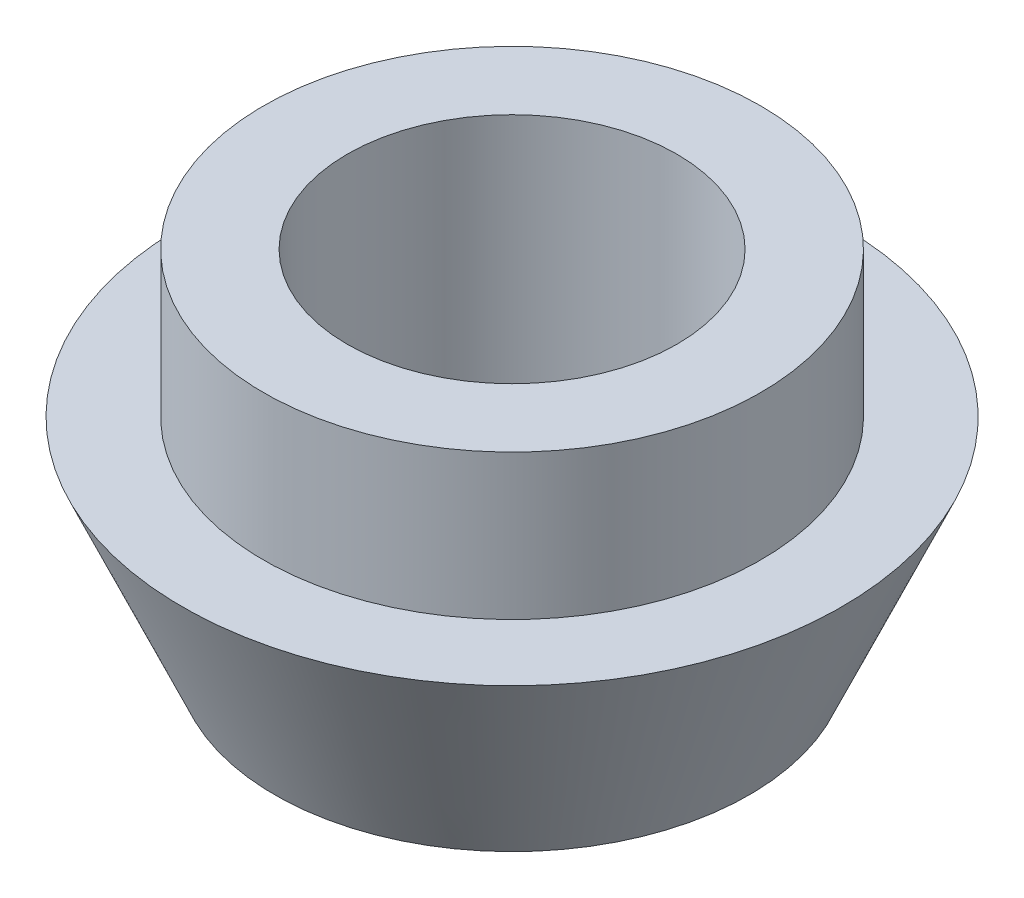
ISO-10303-21;
HEADER;
FILE_DESCRIPTION(('STEP AP214'),'2;1');
FILE_NAME('part.step','',(''),(''),'','','');
FILE_SCHEMA(('AUTOMOTIVE_DESIGN { 1 0 10303 214 1 1 1 1 }'));
ENDSEC;
DATA;
#1=APPLICATION_CONTEXT('core data for automotive mechanical design processes');
#2=APPLICATION_PROTOCOL_DEFINITION('international standard','automotive_design',2000,#1);
#3=PRODUCT_CONTEXT('',#1,'mechanical');
#4=PRODUCT('Part','Part','',(#3));
#5=PRODUCT_RELATED_PRODUCT_CATEGORY('part','',(#4));
#6=PRODUCT_DEFINITION_FORMATION('','',#4);
#7=PRODUCT_DEFINITION_CONTEXT('part definition',#1,'design');
#8=PRODUCT_DEFINITION('design','',#6,#7);
#9=PRODUCT_DEFINITION_SHAPE('','',#8);
#10=(LENGTH_UNIT() NAMED_UNIT(*) SI_UNIT(.MILLI.,.METRE.));
#11=(NAMED_UNIT(*) PLANE_ANGLE_UNIT() SI_UNIT($,.RADIAN.));
#12=(NAMED_UNIT(*) SI_UNIT($,.STERADIAN.) SOLID_ANGLE_UNIT());
#13=UNCERTAINTY_MEASURE_WITH_UNIT(LENGTH_MEASURE(1.E-05),#10,'distance_accuracy_value','');
#14=(GEOMETRIC_REPRESENTATION_CONTEXT(3) GLOBAL_UNCERTAINTY_ASSIGNED_CONTEXT((#13)) GLOBAL_UNIT_ASSIGNED_CONTEXT((#10,
#11,#12)) REPRESENTATION_CONTEXT('',''));
#15=CARTESIAN_POINT('',(0.,0.,0.));
#16=DIRECTION('',(0.,0.,1.));
#17=DIRECTION('',(1.,0.,0.));
#18=AXIS2_PLACEMENT_3D('',#15,#16,#17);
#19=CARTESIAN_POINT('',(4.572,0.,0.));
#20=DIRECTION('',(0.,-1.,0.));
#21=DIRECTION('',(0.,0.,-1.));
#22=AXIS2_PLACEMENT_3D('',#19,#20,#21);
#23=PLANE('',#22);
#24=CARTESIAN_POINT('',(0.,0.,0.));
#25=DIRECTION('',(0.,-1.,0.));
#26=DIRECTION('',(0.,0.,-1.));
#27=AXIS2_PLACEMENT_3D('',#24,#25,#26);
#28=CIRCLE('',#27,4.572);
#29=CARTESIAN_POINT('',(0.,0.,-4.572));
#30=VERTEX_POINT('',#29);
#31=EDGE_CURVE('E55',#30,#30,#28,.T.);
#32=ORIENTED_EDGE('',*,*,#31,.T.);
#33=EDGE_LOOP('',(#32));
#34=FACE_BOUND('',#33,.T.);
#35=CARTESIAN_POINT('',(0.,0.,0.));
#36=DIRECTION('',(0.,-1.,0.));
#37=DIRECTION('',(0.,0.,-1.));
#38=AXIS2_PLACEMENT_3D('',#35,#36,#37);
#39=CIRCLE('',#38,3.175);
#40=CARTESIAN_POINT('',(0.,0.,-3.175));
#41=VERTEX_POINT('',#40);
#42=EDGE_CURVE('E10',#41,#41,#39,.T.);
#43=ORIENTED_EDGE('',*,*,#42,.F.);
#44=EDGE_LOOP('',(#43));
#45=FACE_BOUND('',#44,.T.);
#46=ADVANCED_FACE('F33',(#34,#45),#23,.T.);
#47=CARTESIAN_POINT('',(0.,-15.0878609773988,0.));
#48=DIRECTION('',(0.,-1.,0.));
#49=DIRECTION('',(0.,0.,-1.));
#50=AXIS2_PLACEMENT_3D('',#47,#48,#49);
#51=CYLINDRICAL_SURFACE('',#50,3.175);
#52=ORIENTED_EDGE('',*,*,#42,.T.);
#53=EDGE_LOOP('',(#52));
#54=FACE_BOUND('',#53,.T.);
#55=CARTESIAN_POINT('',(0.,6.8199,0.));
#56=DIRECTION('',(0.,-1.,0.));
#57=DIRECTION('',(0.,0.,-1.));
#58=AXIS2_PLACEMENT_3D('',#55,#56,#57);
#59=CIRCLE('',#58,3.175);
#60=CARTESIAN_POINT('',(0.,6.8199,-3.175));
#61=VERTEX_POINT('',#60);
#62=EDGE_CURVE('E39',#61,#61,#59,.T.);
#63=ORIENTED_EDGE('',*,*,#62,.F.);
#64=EDGE_LOOP('',(#63));
#65=FACE_BOUND('',#64,.T.);
#66=ADVANCED_FACE('F73',(#54,#65),#51,.F.);
#67=CARTESIAN_POINT('',(3.96875,6.8199,0.));
#68=DIRECTION('',(0.,1.,0.));
#69=DIRECTION('',(0.,0.,1.));
#70=AXIS2_PLACEMENT_3D('',#67,#68,#69);
#71=PLANE('',#70);
#72=ORIENTED_EDGE('',*,*,#62,.T.);
#73=EDGE_LOOP('',(#72));
#74=FACE_BOUND('',#73,.T.);
#75=CARTESIAN_POINT('',(0.,6.8199,0.));
#76=DIRECTION('',(0.,-1.,0.));
#77=DIRECTION('',(0.,0.,-1.));
#78=AXIS2_PLACEMENT_3D('',#75,#76,#77);
#79=CIRCLE('',#78,4.7879);
#80=CARTESIAN_POINT('',(0.,6.8199,-4.7879));
#81=VERTEX_POINT('',#80);
#82=EDGE_CURVE('E43',#81,#81,#79,.T.);
#83=ORIENTED_EDGE('',*,*,#82,.F.);
#84=EDGE_LOOP('',(#83));
#85=FACE_BOUND('',#84,.T.);
#86=ADVANCED_FACE('F77',(#74,#85),#71,.T.);
#87=CARTESIAN_POINT('',(0.,-15.0878609773988,0.));
#88=DIRECTION('',(0.,-1.,0.));
#89=DIRECTION('',(0.,0.,-1.));
#90=AXIS2_PLACEMENT_3D('',#87,#88,#89);
#91=CYLINDRICAL_SURFACE('',#90,4.7879);
#92=ORIENTED_EDGE('',*,*,#82,.T.);
#93=EDGE_LOOP('',(#92));
#94=FACE_BOUND('',#93,.T.);
#95=CARTESIAN_POINT('',(0.,4.0259,0.));
#96=DIRECTION('',(0.,-1.,0.));
#97=DIRECTION('',(0.,0.,-1.));
#98=AXIS2_PLACEMENT_3D('',#95,#96,#97);
#99=CIRCLE('',#98,4.7879);
#100=CARTESIAN_POINT('',(0.,4.0259,-4.7879));
#101=VERTEX_POINT('',#100);
#102=EDGE_CURVE('E47',#101,#101,#99,.T.);
#103=ORIENTED_EDGE('',*,*,#102,.F.);
#104=EDGE_LOOP('',(#103));
#105=FACE_BOUND('',#104,.T.);
#106=ADVANCED_FACE('F69',(#94,#105),#91,.T.);
#107=CARTESIAN_POINT('',(4.7879,4.0259,0.));
#108=DIRECTION('',(0.,1.,0.));
#109=DIRECTION('',(0.,0.,1.));
#110=AXIS2_PLACEMENT_3D('',#107,#108,#109);
#111=PLANE('',#110);
#112=ORIENTED_EDGE('',*,*,#102,.T.);
#113=EDGE_LOOP('',(#112));
#114=FACE_BOUND('',#113,.T.);
#115=CARTESIAN_POINT('',(0.,4.0259,0.));
#116=DIRECTION('',(0.,-1.,0.));
#117=DIRECTION('',(0.,0.,-1.));
#118=AXIS2_PLACEMENT_3D('',#115,#116,#117);
#119=CIRCLE('',#118,6.35);
#120=CARTESIAN_POINT('',(0.,4.0259,-6.35));
#121=VERTEX_POINT('',#120);
#122=EDGE_CURVE('E52',#121,#121,#119,.T.);
#123=ORIENTED_EDGE('',*,*,#122,.F.);
#124=EDGE_LOOP('',(#123));
#125=FACE_BOUND('',#124,.T.);
#126=ADVANCED_FACE('F63',(#114,#125),#111,.T.);
#127=CARTESIAN_POINT('',(0.,0.,0.));
#128=DIRECTION('',(0.,1.,0.));
#129=DIRECTION('',(0.,0.,1.));
#130=AXIS2_PLACEMENT_3D('',#127,#128,#129);
#131=CONICAL_SURFACE('',#130,4.572,0.415880354967817);
#132=ORIENTED_EDGE('',*,*,#122,.T.);
#133=EDGE_LOOP('',(#132));
#134=FACE_BOUND('',#133,.T.);
#135=ORIENTED_EDGE('',*,*,#31,.F.);
#136=EDGE_LOOP('',(#135));
#137=FACE_BOUND('',#136,.T.);
#138=ADVANCED_FACE('F61',(#134,#137),#131,.T.);
#139=CLOSED_SHELL('',(#46,#66,#86,#106,#126,#138));
#140=MANIFOLD_SOLID_BREP('B2',#139);
#141=ADVANCED_BREP_SHAPE_REPRESENTATION('',(#18,#140),#14);
#142=SHAPE_DEFINITION_REPRESENTATION(#9,#141);
ENDSEC;
END-ISO-10303-21;
